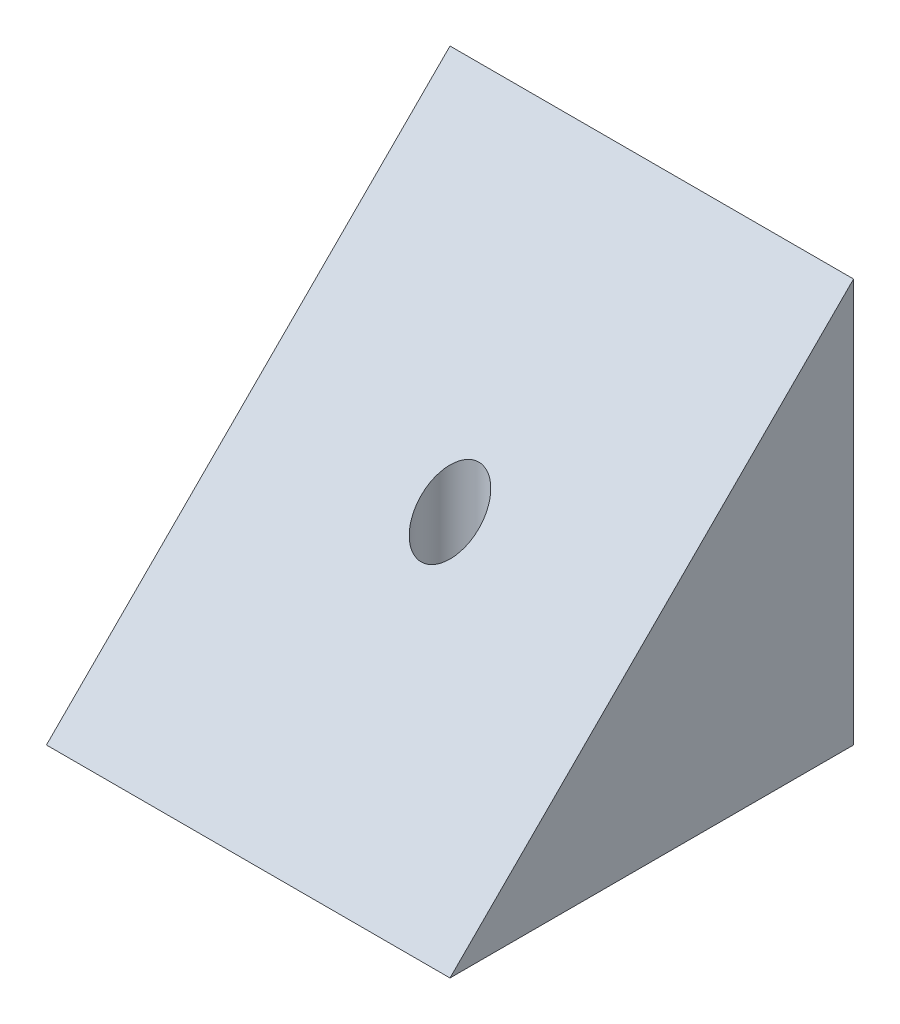
ISO-10303-21;
HEADER;
FILE_DESCRIPTION(('STEP AP214'),'2;1');
FILE_NAME('part.step','',(''),(''),'','','');
FILE_SCHEMA(('AUTOMOTIVE_DESIGN { 1 0 10303 214 1 1 1 1 }'));
ENDSEC;
DATA;
#1=APPLICATION_CONTEXT('core data for automotive mechanical design processes');
#2=APPLICATION_PROTOCOL_DEFINITION('international standard','automotive_design',2000,#1);
#3=PRODUCT_CONTEXT('',#1,'mechanical');
#4=PRODUCT('Part','Part','',(#3));
#5=PRODUCT_RELATED_PRODUCT_CATEGORY('part','',(#4));
#6=PRODUCT_DEFINITION_FORMATION('','',#4);
#7=PRODUCT_DEFINITION_CONTEXT('part definition',#1,'design');
#8=PRODUCT_DEFINITION('design','',#6,#7);
#9=PRODUCT_DEFINITION_SHAPE('','',#8);
#10=(LENGTH_UNIT() NAMED_UNIT(*) SI_UNIT(.MILLI.,.METRE.));
#11=(NAMED_UNIT(*) PLANE_ANGLE_UNIT() SI_UNIT($,.RADIAN.));
#12=(NAMED_UNIT(*) SI_UNIT($,.STERADIAN.) SOLID_ANGLE_UNIT());
#13=UNCERTAINTY_MEASURE_WITH_UNIT(LENGTH_MEASURE(1.E-05),#10,'distance_accuracy_value','');
#14=(GEOMETRIC_REPRESENTATION_CONTEXT(3) GLOBAL_UNCERTAINTY_ASSIGNED_CONTEXT((#13)) GLOBAL_UNIT_ASSIGNED_CONTEXT((#10,
#11,#12)) REPRESENTATION_CONTEXT('',''));
#15=CARTESIAN_POINT('',(0.,0.,0.));
#16=DIRECTION('',(0.,0.,1.));
#17=DIRECTION('',(1.,0.,0.));
#18=AXIS2_PLACEMENT_3D('',#15,#16,#17);
#19=CARTESIAN_POINT('',(0.,0.,14.));
#20=DIRECTION('',(1.,0.,0.));
#21=DIRECTION('',(0.,1.,0.));
#22=AXIS2_PLACEMENT_3D('',#19,#20,#21);
#23=PLANE('',#22);
#24=DIRECTION('',(0.,0.,-1.));
#25=VECTOR('',#24,1.);
#26=CARTESIAN_POINT('',(0.,0.,14.));
#27=LINE('',#26,#25);
#28=CARTESIAN_POINT('',(0.,0.,14.));
#29=VERTEX_POINT('',#28);
#30=CARTESIAN_POINT('',(0.,0.,0.));
#31=VERTEX_POINT('',#30);
#32=EDGE_CURVE('E68',#29,#31,#27,.T.);
#33=ORIENTED_EDGE('',*,*,#32,.F.);
#34=DIRECTION('',(0.,-0.707106781186546,0.707106781186549));
#35=VECTOR('',#34,1.);
#36=CARTESIAN_POINT('',(0.,0.,14.));
#37=LINE('',#36,#35);
#38=CARTESIAN_POINT('',(0.,14.,0.));
#39=VERTEX_POINT('',#38);
#40=EDGE_CURVE('E41',#29,#39,#37,.F.);
#41=ORIENTED_EDGE('',*,*,#40,.T.);
#42=DIRECTION('',(0.,-1.,0.));
#43=VECTOR('',#42,1.);
#44=CARTESIAN_POINT('',(0.,0.,0.));
#45=LINE('',#44,#43);
#46=EDGE_CURVE('E66',#39,#31,#45,.T.);
#47=ORIENTED_EDGE('',*,*,#46,.T.);
#48=EDGE_LOOP('',(#33,#41,#47));
#49=FACE_BOUND('',#48,.T.);
#50=ADVANCED_FACE('F31',(#49),#23,.F.);
#51=CARTESIAN_POINT('',(0.,0.,14.));
#52=DIRECTION('',(0.,1.,0.));
#53=DIRECTION('',(0.,0.,1.));
#54=AXIS2_PLACEMENT_3D('',#51,#52,#53);
#55=PLANE('',#54);
#56=CARTESIAN_POINT('',(7.00000000000001,0.,7.));
#57=DIRECTION('',(0.,-1.,0.));
#58=DIRECTION('',(0.,0.,-1.));
#59=AXIS2_PLACEMENT_3D('',#56,#57,#58);
#60=CIRCLE('',#59,1.);
#61=CARTESIAN_POINT('',(7.00000000000001,0.,6.));
#62=VERTEX_POINT('',#61);
#63=EDGE_CURVE('E137',#62,#62,#60,.T.);
#64=ORIENTED_EDGE('',*,*,#63,.F.);
#65=EDGE_LOOP('',(#64));
#66=FACE_BOUND('',#65,.T.);
#67=DIRECTION('',(1.,0.,0.));
#68=VECTOR('',#67,1.);
#69=CARTESIAN_POINT('',(0.,0.,0.));
#70=LINE('',#69,#68);
#71=CARTESIAN_POINT('',(14.,0.,0.));
#72=VERTEX_POINT('',#71);
#73=EDGE_CURVE('E77',#31,#72,#70,.T.);
#74=ORIENTED_EDGE('',*,*,#73,.T.);
#75=DIRECTION('',(0.,0.,-1.));
#76=VECTOR('',#75,1.);
#77=CARTESIAN_POINT('',(14.,0.,14.));
#78=LINE('',#77,#76);
#79=CARTESIAN_POINT('',(14.,0.,14.));
#80=VERTEX_POINT('',#79);
#81=EDGE_CURVE('E81',#80,#72,#78,.T.);
#82=ORIENTED_EDGE('',*,*,#81,.F.);
#83=DIRECTION('',(1.,0.,0.));
#84=VECTOR('',#83,1.);
#85=CARTESIAN_POINT('',(0.,0.,14.));
#86=LINE('',#85,#84);
#87=EDGE_CURVE('E79',#29,#80,#86,.T.);
#88=ORIENTED_EDGE('',*,*,#87,.F.);
#89=ORIENTED_EDGE('',*,*,#32,.T.);
#90=EDGE_LOOP('',(#74,#82,#88,#89));
#91=FACE_BOUND('',#90,.T.);
#92=ADVANCED_FACE('F88',(#66,#91),#55,.F.);
#93=CARTESIAN_POINT('',(14.,0.,14.));
#94=DIRECTION('',(-1.,0.,0.));
#95=DIRECTION('',(0.,-1.,0.));
#96=AXIS2_PLACEMENT_3D('',#93,#94,#95);
#97=PLANE('',#96);
#98=DIRECTION('',(0.,1.,0.));
#99=VECTOR('',#98,1.);
#100=CARTESIAN_POINT('',(14.,0.,0.));
#101=LINE('',#100,#99);
#102=CARTESIAN_POINT('',(14.,14.,0.));
#103=VERTEX_POINT('',#102);
#104=EDGE_CURVE('E59',#72,#103,#101,.T.);
#105=ORIENTED_EDGE('',*,*,#104,.T.);
#106=DIRECTION('',(0.,0.707106781186546,-0.707106781186549));
#107=VECTOR('',#106,1.);
#108=CARTESIAN_POINT('',(14.,0.,14.));
#109=LINE('',#108,#107);
#110=EDGE_CURVE('E11',#103,#80,#109,.F.);
#111=ORIENTED_EDGE('',*,*,#110,.T.);
#112=ORIENTED_EDGE('',*,*,#81,.T.);
#113=EDGE_LOOP('',(#105,#111,#112));
#114=FACE_BOUND('',#113,.T.);
#115=ADVANCED_FACE('F89',(#114),#97,.F.);
#116=CARTESIAN_POINT('',(0.,14.,0.));
#117=DIRECTION('',(0.,0.,-1.));
#118=DIRECTION('',(-1.,0.,0.));
#119=AXIS2_PLACEMENT_3D('',#116,#117,#118);
#120=PLANE('',#119);
#121=ORIENTED_EDGE('',*,*,#46,.F.);
#122=DIRECTION('',(-1.,0.,0.));
#123=VECTOR('',#122,1.);
#124=CARTESIAN_POINT('',(0.,14.,0.));
#125=LINE('',#124,#123);
#126=EDGE_CURVE('E76',#103,#39,#125,.T.);
#127=ORIENTED_EDGE('',*,*,#126,.F.);
#128=ORIENTED_EDGE('',*,*,#104,.F.);
#129=ORIENTED_EDGE('',*,*,#73,.F.);
#130=EDGE_LOOP('',(#121,#127,#128,#129));
#131=FACE_BOUND('',#130,.T.);
#132=ADVANCED_FACE('F75',(#131),#120,.T.);
#133=CARTESIAN_POINT('',(0.,0.,14.));
#134=DIRECTION('',(0.,-0.707106781186549,-0.707106781186546));
#135=DIRECTION('',(0.,0.707106781186546,-0.707106781186549));
#136=AXIS2_PLACEMENT_3D('',#133,#134,#135);
#137=PLANE('',#136);
#138=CARTESIAN_POINT('',(7.00000000000001,6.99999999999998,7.));
#139=DIRECTION('',(0.,-0.707106781186549,-0.707106781186546));
#140=DIRECTION('',(0.,-0.707106781186546,0.707106781186549));
#141=AXIS2_PLACEMENT_3D('',#138,#139,#140);
#142=ELLIPSE('',#141,1.41421356237309,1.);
#143=CARTESIAN_POINT('',(7.00000000000001,5.99999999999998,8.));
#144=VERTEX_POINT('',#143);
#145=EDGE_CURVE('E35',#144,#144,#142,.F.);
#146=ORIENTED_EDGE('',*,*,#145,.F.);
#147=EDGE_LOOP('',(#146));
#148=FACE_BOUND('',#147,.T.);
#149=ORIENTED_EDGE('',*,*,#110,.F.);
#150=ORIENTED_EDGE('',*,*,#126,.T.);
#151=ORIENTED_EDGE('',*,*,#40,.F.);
#152=ORIENTED_EDGE('',*,*,#87,.T.);
#153=EDGE_LOOP('',(#149,#150,#151,#152));
#154=FACE_BOUND('',#153,.T.);
#155=ADVANCED_FACE('F33',(#148,#154),#137,.F.);
#156=CARTESIAN_POINT('',(7.00000000000001,14.,7.));
#157=DIRECTION('',(0.,-1.,0.));
#158=DIRECTION('',(0.,0.,-1.));
#159=AXIS2_PLACEMENT_3D('',#156,#157,#158);
#160=CYLINDRICAL_SURFACE('',#159,1.);
#161=ORIENTED_EDGE('',*,*,#145,.T.);
#162=EDGE_LOOP('',(#161));
#163=FACE_BOUND('',#162,.T.);
#164=ORIENTED_EDGE('',*,*,#63,.T.);
#165=EDGE_LOOP('',(#164));
#166=FACE_BOUND('',#165,.T.);
#167=ADVANCED_FACE('F119',(#163,#166),#160,.F.);
#168=CLOSED_SHELL('',(#50,#92,#115,#132,#155,#167));
#169=MANIFOLD_SOLID_BREP('B2',#168);
#170=ADVANCED_BREP_SHAPE_REPRESENTATION('',(#18,#169),#14);
#171=SHAPE_DEFINITION_REPRESENTATION(#9,#170);
ENDSEC;
END-ISO-10303-21;
